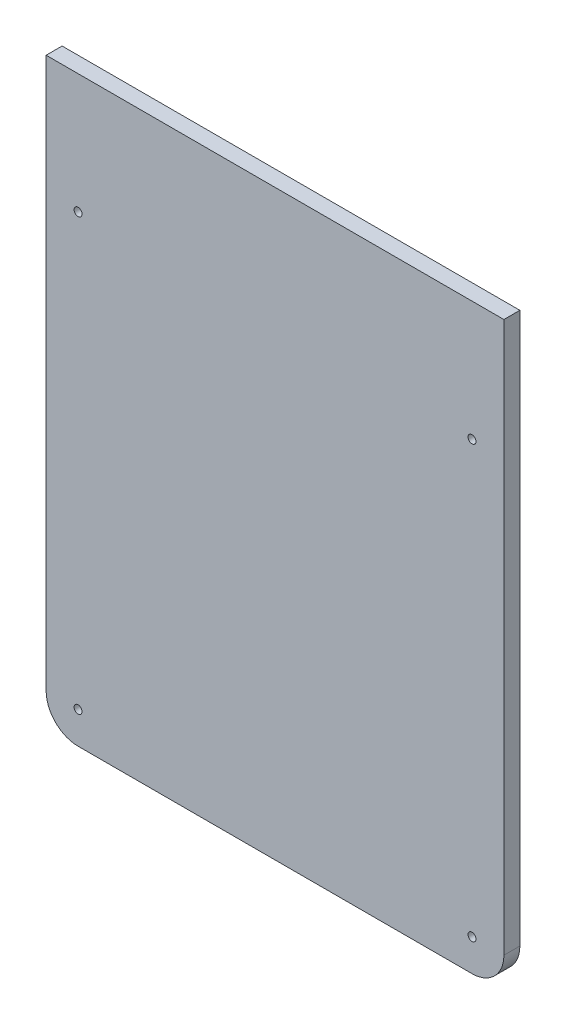
ISO-10303-21;
HEADER;
FILE_DESCRIPTION(('STEP AP214'),'2;1');
FILE_NAME('part.step','',(''),(''),'','','');
FILE_SCHEMA(('AUTOMOTIVE_DESIGN { 1 0 10303 214 1 1 1 1 }'));
ENDSEC;
DATA;
#1=APPLICATION_CONTEXT('core data for automotive mechanical design processes');
#2=APPLICATION_PROTOCOL_DEFINITION('international standard','automotive_design',2000,#1);
#3=PRODUCT_CONTEXT('',#1,'mechanical');
#4=PRODUCT('Part','Part','',(#3));
#5=PRODUCT_RELATED_PRODUCT_CATEGORY('part','',(#4));
#6=PRODUCT_DEFINITION_FORMATION('','',#4);
#7=PRODUCT_DEFINITION_CONTEXT('part definition',#1,'design');
#8=PRODUCT_DEFINITION('design','',#6,#7);
#9=PRODUCT_DEFINITION_SHAPE('','',#8);
#10=(LENGTH_UNIT() NAMED_UNIT(*) SI_UNIT(.MILLI.,.METRE.));
#11=(NAMED_UNIT(*) PLANE_ANGLE_UNIT() SI_UNIT($,.RADIAN.));
#12=(NAMED_UNIT(*) SI_UNIT($,.STERADIAN.) SOLID_ANGLE_UNIT());
#13=UNCERTAINTY_MEASURE_WITH_UNIT(LENGTH_MEASURE(1.E-05),#10,'distance_accuracy_value','');
#14=(GEOMETRIC_REPRESENTATION_CONTEXT(3) GLOBAL_UNCERTAINTY_ASSIGNED_CONTEXT((#13)) GLOBAL_UNIT_ASSIGNED_CONTEXT((#10,
#11,#12)) REPRESENTATION_CONTEXT('',''));
#15=CARTESIAN_POINT('',(0.,0.,0.));
#16=DIRECTION('',(0.,0.,1.));
#17=DIRECTION('',(1.,0.,0.));
#18=AXIS2_PLACEMENT_3D('',#15,#16,#17);
#19=CARTESIAN_POINT('',(163.099999994002,683.952163009711,6.34999999999797));
#20=DIRECTION('',(-1.,0.,0.));
#21=DIRECTION('',(0.,-0.999999999999997,0.));
#22=AXIS2_PLACEMENT_3D('',#19,#20,#21);
#23=PLANE('',#22);
#24=DIRECTION('',(0.,0.999999999999997,0.));
#25=VECTOR('',#24,1.);
#26=CARTESIAN_POINT('',(163.099999994002,683.95216300971,-1.22124532708767E-12));
#27=LINE('',#26,#25);
#28=CARTESIAN_POINT('',(163.099999994002,683.95216300971,-1.22124532708767E-12));
#29=VERTEX_POINT('',#28);
#30=CARTESIAN_POINT('',(163.099999994006,903.027163009701,-7.7715611723761E-13));
#31=VERTEX_POINT('',#30);
#32=EDGE_CURVE('E122',#29,#31,#27,.T.);
#33=ORIENTED_EDGE('',*,*,#32,.T.);
#34=DIRECTION('',(0.,0.,-0.999999999999997));
#35=VECTOR('',#34,1.);
#36=CARTESIAN_POINT('',(163.099999994005,903.0271630097,6.34999999999941));
#37=LINE('',#36,#35);
#38=CARTESIAN_POINT('',(163.099999994005,903.0271630097,6.34999999999941));
#39=VERTEX_POINT('',#38);
#40=EDGE_CURVE('E11',#39,#31,#37,.T.);
#41=ORIENTED_EDGE('',*,*,#40,.F.);
#42=DIRECTION('',(0.,0.999999999999997,0.));
#43=VECTOR('',#42,1.);
#44=CARTESIAN_POINT('',(163.099999994002,683.952163009711,6.34999999999797));
#45=LINE('',#44,#43);
#46=CARTESIAN_POINT('',(163.099999994002,683.952163009711,6.34999999999797));
#47=VERTEX_POINT('',#46);
#48=EDGE_CURVE('E133',#47,#39,#45,.T.);
#49=ORIENTED_EDGE('',*,*,#48,.F.);
#50=DIRECTION('',(0.,0.,-0.999999999999997));
#51=VECTOR('',#50,1.);
#52=CARTESIAN_POINT('',(163.099999994002,683.952163009711,6.34999999999797));
#53=LINE('',#52,#51);
#54=EDGE_CURVE('E118',#47,#29,#53,.T.);
#55=ORIENTED_EDGE('',*,*,#54,.T.);
#56=EDGE_LOOP('',(#33,#41,#49,#55));
#57=FACE_BOUND('',#56,.T.);
#58=ADVANCED_FACE('F36',(#57),#23,.F.);
#59=CARTESIAN_POINT('',(-19.0500000000007,903.027163009696,6.34999999999941));
#60=DIRECTION('',(0.,-0.999999999999997,0.));
#61=DIRECTION('',(1.,0.,0.));
#62=AXIS2_PLACEMENT_3D('',#59,#60,#61);
#63=PLANE('',#62);
#64=DIRECTION('',(-1.,0.,0.));
#65=VECTOR('',#64,1.);
#66=CARTESIAN_POINT('',(-19.0500000000005,903.027163009695,-3.33066907387547E-13));
#67=LINE('',#66,#65);
#68=CARTESIAN_POINT('',(-19.0500000000005,903.027163009695,-3.33066907387547E-13));
#69=VERTEX_POINT('',#68);
#70=EDGE_CURVE('E125',#31,#69,#67,.T.);
#71=ORIENTED_EDGE('',*,*,#70,.T.);
#72=DIRECTION('',(0.,0.,-0.999999999999997));
#73=VECTOR('',#72,1.);
#74=CARTESIAN_POINT('',(-19.0500000000007,903.027163009696,6.34999999999941));
#75=LINE('',#74,#73);
#76=CARTESIAN_POINT('',(-19.0500000000007,903.027163009696,6.34999999999941));
#77=VERTEX_POINT('',#76);
#78=EDGE_CURVE('E45',#77,#69,#75,.T.);
#79=ORIENTED_EDGE('',*,*,#78,.F.);
#80=DIRECTION('',(-1.,0.,0.));
#81=VECTOR('',#80,1.);
#82=CARTESIAN_POINT('',(-19.0500000000007,903.027163009696,6.34999999999941));
#83=LINE('',#82,#81);
#84=EDGE_CURVE('E91',#39,#77,#83,.T.);
#85=ORIENTED_EDGE('',*,*,#84,.F.);
#86=ORIENTED_EDGE('',*,*,#40,.T.);
#87=EDGE_LOOP('',(#71,#79,#85,#86));
#88=FACE_BOUND('',#87,.T.);
#89=ADVANCED_FACE('F166',(#88),#63,.F.);
#90=CARTESIAN_POINT('',(-19.0500000000007,903.027163009696,6.34999999999941));
#91=DIRECTION('',(1.,0.,0.));
#92=DIRECTION('',(0.,0.999999999999997,0.));
#93=AXIS2_PLACEMENT_3D('',#90,#91,#92);
#94=PLANE('',#93);
#95=DIRECTION('',(0.,-0.999999999999997,0.));
#96=VECTOR('',#95,1.);
#97=CARTESIAN_POINT('',(-19.0500000000005,903.027163009695,-3.33066907387547E-13));
#98=LINE('',#97,#96);
#99=CARTESIAN_POINT('',(-19.0500000000002,683.952163009709,-9.99200722162641E-13));
#100=VERTEX_POINT('',#99);
#101=EDGE_CURVE('E128',#69,#100,#98,.T.);
#102=ORIENTED_EDGE('',*,*,#101,.T.);
#103=DIRECTION('',(0.,0.,-0.999999999999997));
#104=VECTOR('',#103,1.);
#105=CARTESIAN_POINT('',(-19.0499999999997,683.95216300971,6.34999999999974));
#106=LINE('',#105,#104);
#107=CARTESIAN_POINT('',(-19.0499999999997,683.95216300971,6.34999999999974));
#108=VERTEX_POINT('',#107);
#109=EDGE_CURVE('E113',#108,#100,#106,.T.);
#110=ORIENTED_EDGE('',*,*,#109,.F.);
#111=DIRECTION('',(0.,-0.999999999999997,0.));
#112=VECTOR('',#111,1.);
#113=CARTESIAN_POINT('',(-19.0500000000007,903.027163009696,6.34999999999941));
#114=LINE('',#113,#112);
#115=EDGE_CURVE('E104',#77,#108,#114,.T.);
#116=ORIENTED_EDGE('',*,*,#115,.F.);
#117=ORIENTED_EDGE('',*,*,#78,.T.);
#118=EDGE_LOOP('',(#102,#110,#116,#117));
#119=FACE_BOUND('',#118,.T.);
#120=ADVANCED_FACE('F169',(#119),#94,.F.);
#121=CARTESIAN_POINT('',(-6.34999999999974,683.952163009713,6.34999999999819));
#122=DIRECTION('',(0.,0.,-0.999999999999997));
#123=DIRECTION('',(-1.,0.,0.));
#124=AXIS2_PLACEMENT_3D('',#121,#122,#123);
#125=CYLINDRICAL_SURFACE('',#124,12.7);
#126=CARTESIAN_POINT('',(-6.35000000000019,683.952163009711,-2.99760216648792E-12));
#127=DIRECTION('',(0.,0.,0.999999999999997));
#128=DIRECTION('',(1.,0.,0.));
#129=AXIS2_PLACEMENT_3D('',#126,#127,#128);
#130=CIRCLE('',#129,12.7);
#131=CARTESIAN_POINT('',(-6.35000000000019,671.252163009714,-4.44089209850063E-13));
#132=VERTEX_POINT('',#131);
#133=EDGE_CURVE('E112',#100,#132,#130,.T.);
#134=ORIENTED_EDGE('',*,*,#133,.T.);
#135=DIRECTION('',(0.,0.,-0.999999999999997));
#136=VECTOR('',#135,1.);
#137=CARTESIAN_POINT('',(-6.35000000000012,671.252163009714,6.34999999999974));
#138=LINE('',#137,#136);
#139=CARTESIAN_POINT('',(-6.35000000000012,671.252163009714,6.34999999999974));
#140=VERTEX_POINT('',#139);
#141=EDGE_CURVE('E109',#140,#132,#138,.T.);
#142=ORIENTED_EDGE('',*,*,#141,.F.);
#143=CARTESIAN_POINT('',(-6.34999999999974,683.952163009713,6.34999999999819));
#144=DIRECTION('',(0.,0.,0.999999999999997));
#145=DIRECTION('',(1.,0.,0.));
#146=AXIS2_PLACEMENT_3D('',#143,#144,#145);
#147=CIRCLE('',#146,12.7);
#148=EDGE_CURVE('E98',#108,#140,#147,.T.);
#149=ORIENTED_EDGE('',*,*,#148,.F.);
#150=ORIENTED_EDGE('',*,*,#109,.T.);
#151=EDGE_LOOP('',(#134,#142,#149,#150));
#152=FACE_BOUND('',#151,.T.);
#153=ADVANCED_FACE('F110',(#152),#125,.T.);
#154=CARTESIAN_POINT('',(-6.35000000000012,671.252163009714,6.34999999999974));
#155=DIRECTION('',(0.,0.999999999999997,0.));
#156=DIRECTION('',(-1.,0.,0.));
#157=AXIS2_PLACEMENT_3D('',#154,#155,#156);
#158=PLANE('',#157);
#159=DIRECTION('',(1.,0.,0.));
#160=VECTOR('',#159,1.);
#161=CARTESIAN_POINT('',(-6.35000000000017,671.252163009714,-4.44089209850063E-13));
#162=LINE('',#161,#160);
#163=CARTESIAN_POINT('',(150.399999994002,671.252163009709,-4.44089209850063E-13));
#164=VERTEX_POINT('',#163);
#165=EDGE_CURVE('E77',#132,#164,#162,.T.);
#166=ORIENTED_EDGE('',*,*,#165,.T.);
#167=DIRECTION('',(0.,0.,-0.999999999999997));
#168=VECTOR('',#167,1.);
#169=CARTESIAN_POINT('',(150.399999994002,671.252163009709,6.34999999999974));
#170=LINE('',#169,#168);
#171=CARTESIAN_POINT('',(150.399999994002,671.252163009709,6.34999999999974));
#172=VERTEX_POINT('',#171);
#173=EDGE_CURVE('E114',#172,#164,#170,.T.);
#174=ORIENTED_EDGE('',*,*,#173,.F.);
#175=DIRECTION('',(1.,0.,0.));
#176=VECTOR('',#175,1.);
#177=CARTESIAN_POINT('',(-6.35000000000012,671.252163009714,6.34999999999974));
#178=LINE('',#177,#176);
#179=EDGE_CURVE('E102',#140,#172,#178,.T.);
#180=ORIENTED_EDGE('',*,*,#179,.F.);
#181=ORIENTED_EDGE('',*,*,#141,.T.);
#182=EDGE_LOOP('',(#166,#174,#180,#181));
#183=FACE_BOUND('',#182,.T.);
#184=ADVANCED_FACE('F116',(#183),#158,.F.);
#185=CARTESIAN_POINT('',(150.399999994002,683.95216300971,6.34999999999997));
#186=DIRECTION('',(0.,0.,-0.999999999999997));
#187=DIRECTION('',(-1.,0.,0.));
#188=AXIS2_PLACEMENT_3D('',#185,#186,#187);
#189=CYLINDRICAL_SURFACE('',#188,12.7);
#190=CARTESIAN_POINT('',(150.399999994002,683.952163009708,-5.55111512312578E-13));
#191=DIRECTION('',(0.,0.,0.999999999999997));
#192=DIRECTION('',(1.,0.,0.));
#193=AXIS2_PLACEMENT_3D('',#190,#191,#192);
#194=CIRCLE('',#193,12.7);
#195=EDGE_CURVE('E83',#164,#29,#194,.T.);
#196=ORIENTED_EDGE('',*,*,#195,.T.);
#197=ORIENTED_EDGE('',*,*,#54,.F.);
#198=CARTESIAN_POINT('',(150.399999994002,683.95216300971,6.34999999999997));
#199=DIRECTION('',(0.,0.,0.999999999999997));
#200=DIRECTION('',(1.,0.,0.));
#201=AXIS2_PLACEMENT_3D('',#198,#199,#200);
#202=CIRCLE('',#201,12.7);
#203=EDGE_CURVE('E54',#172,#47,#202,.T.);
#204=ORIENTED_EDGE('',*,*,#203,.F.);
#205=ORIENTED_EDGE('',*,*,#173,.T.);
#206=EDGE_LOOP('',(#196,#197,#204,#205));
#207=FACE_BOUND('',#206,.T.);
#208=ADVANCED_FACE('F174',(#207),#189,.T.);
#209=CARTESIAN_POINT('',(-6.34999999999974,683.952163009713,6.34999999999819));
#210=DIRECTION('',(0.,0.,0.999999999999997));
#211=DIRECTION('',(1.,0.,0.));
#212=AXIS2_PLACEMENT_3D('',#209,#210,#211);
#213=PLANE('',#212);
#214=CARTESIAN_POINT('',(-6.349999999998,855.402163009702,6.3499999999983));
#215=DIRECTION('',(0.,0.,0.999999999999997));
#216=DIRECTION('',(1.,0.,0.));
#217=AXIS2_PLACEMENT_3D('',#214,#215,#216);
#218=CIRCLE('',#217,1.5875);
#219=CARTESIAN_POINT('',(-4.76249999999799,855.402163009702,6.34999999999831));
#220=VERTEX_POINT('',#219);
#221=EDGE_CURVE('E148',#220,#220,#218,.T.);
#222=ORIENTED_EDGE('',*,*,#221,.F.);
#223=EDGE_LOOP('',(#222));
#224=FACE_BOUND('',#223,.T.);
#225=CARTESIAN_POINT('',(-6.34999999999755,683.952163009705,6.34999999999808));
#226=DIRECTION('',(0.,0.,0.999999999999997));
#227=DIRECTION('',(1.,0.,0.));
#228=AXIS2_PLACEMENT_3D('',#225,#226,#227);
#229=CIRCLE('',#228,1.5875);
#230=CARTESIAN_POINT('',(-4.76249999999755,683.952163009705,6.34999999999808));
#231=VERTEX_POINT('',#230);
#232=EDGE_CURVE('E145',#231,#231,#229,.T.);
#233=ORIENTED_EDGE('',*,*,#232,.F.);
#234=EDGE_LOOP('',(#233));
#235=FACE_BOUND('',#234,.T.);
#236=CARTESIAN_POINT('',(150.399999994005,683.9521630097,6.3499999999993));
#237=DIRECTION('',(0.,0.,0.999999999999997));
#238=DIRECTION('',(1.,0.,0.));
#239=AXIS2_PLACEMENT_3D('',#236,#237,#238);
#240=CIRCLE('',#239,1.58750000000001);
#241=CARTESIAN_POINT('',(151.987499994005,683.9521630097,6.34999999999931));
#242=VERTEX_POINT('',#241);
#243=EDGE_CURVE('E143',#242,#242,#240,.T.);
#244=ORIENTED_EDGE('',*,*,#243,.F.);
#245=EDGE_LOOP('',(#244));
#246=FACE_BOUND('',#245,.T.);
#247=CARTESIAN_POINT('',(150.399999994004,855.402163009698,6.35000000000063));
#248=DIRECTION('',(0.,0.,0.999999999999997));
#249=DIRECTION('',(1.,0.,0.));
#250=AXIS2_PLACEMENT_3D('',#247,#248,#249);
#251=CIRCLE('',#250,1.58750000000001);
#252=CARTESIAN_POINT('',(151.987499994004,855.402163009698,6.35000000000064));
#253=VERTEX_POINT('',#252);
#254=EDGE_CURVE('E126',#253,#253,#251,.T.);
#255=ORIENTED_EDGE('',*,*,#254,.F.);
#256=EDGE_LOOP('',(#255));
#257=FACE_BOUND('',#256,.T.);
#258=ORIENTED_EDGE('',*,*,#48,.T.);
#259=ORIENTED_EDGE('',*,*,#84,.T.);
#260=ORIENTED_EDGE('',*,*,#115,.T.);
#261=ORIENTED_EDGE('',*,*,#148,.T.);
#262=ORIENTED_EDGE('',*,*,#179,.T.);
#263=ORIENTED_EDGE('',*,*,#203,.T.);
#264=EDGE_LOOP('',(#258,#259,#260,#261,#262,#263));
#265=FACE_BOUND('',#264,.T.);
#266=ADVANCED_FACE('F100',(#224,#235,#246,#257,#265),#213,.T.);
#267=CARTESIAN_POINT('',(-6.35000000000019,683.952163009711,-2.99760216648792E-12));
#268=DIRECTION('',(0.,0.,0.999999999999997));
#269=DIRECTION('',(1.,0.,0.));
#270=AXIS2_PLACEMENT_3D('',#267,#268,#269);
#271=PLANE('',#270);
#272=CARTESIAN_POINT('',(-6.3499999999978,855.402163009702,-2.33146835171283E-12));
#273=DIRECTION('',(0.,0.,0.999999999999997));
#274=DIRECTION('',(1.,0.,0.));
#275=AXIS2_PLACEMENT_3D('',#272,#273,#274);
#276=CIRCLE('',#275,1.5875);
#277=CARTESIAN_POINT('',(-4.7624999999978,855.402163009702,-2.326066636005E-12));
#278=VERTEX_POINT('',#277);
#279=EDGE_CURVE('E39',#278,#278,#276,.T.);
#280=ORIENTED_EDGE('',*,*,#279,.T.);
#281=EDGE_LOOP('',(#280));
#282=FACE_BOUND('',#281,.T.);
#283=CARTESIAN_POINT('',(-6.34999999999798,683.952163009704,-3.21964677141295E-12));
#284=DIRECTION('',(0.,0.,0.999999999999997));
#285=DIRECTION('',(1.,0.,0.));
#286=AXIS2_PLACEMENT_3D('',#283,#284,#285);
#287=CIRCLE('',#286,1.5875);
#288=CARTESIAN_POINT('',(-4.76249999999798,683.952163009704,-3.21424505570513E-12));
#289=VERTEX_POINT('',#288);
#290=EDGE_CURVE('E146',#289,#289,#287,.T.);
#291=ORIENTED_EDGE('',*,*,#290,.T.);
#292=EDGE_LOOP('',(#291));
#293=FACE_BOUND('',#292,.T.);
#294=CARTESIAN_POINT('',(150.399999994005,683.952163009701,-9.99200722162641E-13));
#295=DIRECTION('',(0.,0.,0.999999999999997));
#296=DIRECTION('',(1.,0.,0.));
#297=AXIS2_PLACEMENT_3D('',#294,#295,#296);
#298=CIRCLE('',#297,1.58750000000001);
#299=CARTESIAN_POINT('',(151.987499994005,683.952163009701,-9.93799006454817E-13));
#300=VERTEX_POINT('',#299);
#301=EDGE_CURVE('E142',#300,#300,#298,.T.);
#302=ORIENTED_EDGE('',*,*,#301,.T.);
#303=EDGE_LOOP('',(#302));
#304=FACE_BOUND('',#303,.T.);
#305=CARTESIAN_POINT('',(150.399999994005,855.402163009699,-9.99200722162641E-13));
#306=DIRECTION('',(0.,0.,0.999999999999997));
#307=DIRECTION('',(1.,0.,0.));
#308=AXIS2_PLACEMENT_3D('',#305,#306,#307);
#309=CIRCLE('',#308,1.58750000000001);
#310=CARTESIAN_POINT('',(151.987499994005,855.402163009699,-9.93799006454817E-13));
#311=VERTEX_POINT('',#310);
#312=EDGE_CURVE('E139',#311,#311,#309,.T.);
#313=ORIENTED_EDGE('',*,*,#312,.T.);
#314=EDGE_LOOP('',(#313));
#315=FACE_BOUND('',#314,.T.);
#316=ORIENTED_EDGE('',*,*,#32,.F.);
#317=ORIENTED_EDGE('',*,*,#195,.F.);
#318=ORIENTED_EDGE('',*,*,#165,.F.);
#319=ORIENTED_EDGE('',*,*,#133,.F.);
#320=ORIENTED_EDGE('',*,*,#101,.F.);
#321=ORIENTED_EDGE('',*,*,#70,.F.);
#322=EDGE_LOOP('',(#316,#317,#318,#319,#320,#321));
#323=FACE_BOUND('',#322,.T.);
#324=ADVANCED_FACE('F172',(#282,#293,#304,#315,#323),#271,.F.);
#325=CARTESIAN_POINT('',(150.399999994004,855.402163009697,19.0500000000222));
#326=DIRECTION('',(0.,0.,0.999999999999997));
#327=DIRECTION('',(1.,0.,0.));
#328=AXIS2_PLACEMENT_3D('',#325,#326,#327);
#329=CYLINDRICAL_SURFACE('',#328,1.58750000000001);
#330=ORIENTED_EDGE('',*,*,#254,.T.);
#331=EDGE_LOOP('',(#330));
#332=FACE_BOUND('',#331,.T.);
#333=ORIENTED_EDGE('',*,*,#312,.F.);
#334=EDGE_LOOP('',(#333));
#335=FACE_BOUND('',#334,.T.);
#336=ADVANCED_FACE('F223',(#332,#335),#329,.F.);
#337=CARTESIAN_POINT('',(150.399999994005,683.952163009703,19.0500000000219));
#338=DIRECTION('',(0.,0.,0.999999999999997));
#339=DIRECTION('',(1.,0.,0.));
#340=AXIS2_PLACEMENT_3D('',#337,#338,#339);
#341=CYLINDRICAL_SURFACE('',#340,1.58750000000001);
#342=ORIENTED_EDGE('',*,*,#243,.T.);
#343=EDGE_LOOP('',(#342));
#344=FACE_BOUND('',#343,.T.);
#345=ORIENTED_EDGE('',*,*,#301,.F.);
#346=EDGE_LOOP('',(#345));
#347=FACE_BOUND('',#346,.T.);
#348=ADVANCED_FACE('F232',(#344,#347),#341,.F.);
#349=CARTESIAN_POINT('',(-6.34999999999772,683.952163009704,19.0500000000208));
#350=DIRECTION('',(0.,0.,0.999999999999997));
#351=DIRECTION('',(1.,0.,0.));
#352=AXIS2_PLACEMENT_3D('',#349,#350,#351);
#353=CYLINDRICAL_SURFACE('',#352,1.5875);
#354=ORIENTED_EDGE('',*,*,#232,.T.);
#355=EDGE_LOOP('',(#354));
#356=FACE_BOUND('',#355,.T.);
#357=ORIENTED_EDGE('',*,*,#290,.F.);
#358=EDGE_LOOP('',(#357));
#359=FACE_BOUND('',#358,.T.);
#360=ADVANCED_FACE('F242',(#356,#359),#353,.F.);
#361=CARTESIAN_POINT('',(-6.34999999999776,855.402163009704,19.0500000000214));
#362=DIRECTION('',(0.,0.,0.999999999999997));
#363=DIRECTION('',(1.,0.,0.));
#364=AXIS2_PLACEMENT_3D('',#361,#362,#363);
#365=CYLINDRICAL_SURFACE('',#364,1.5875);
#366=ORIENTED_EDGE('',*,*,#221,.T.);
#367=EDGE_LOOP('',(#366));
#368=FACE_BOUND('',#367,.T.);
#369=ORIENTED_EDGE('',*,*,#279,.F.);
#370=EDGE_LOOP('',(#369));
#371=FACE_BOUND('',#370,.T.);
#372=ADVANCED_FACE('F252',(#368,#371),#365,.F.);
#373=CLOSED_SHELL('',(#58,#89,#120,#153,#184,#208,#266,#324,#336,#348,#360,#372));
#374=MANIFOLD_SOLID_BREP('B2',#373);
#375=ADVANCED_BREP_SHAPE_REPRESENTATION('',(#18,#374),#14);
#376=SHAPE_DEFINITION_REPRESENTATION(#9,#375);
ENDSEC;
END-ISO-10303-21;
